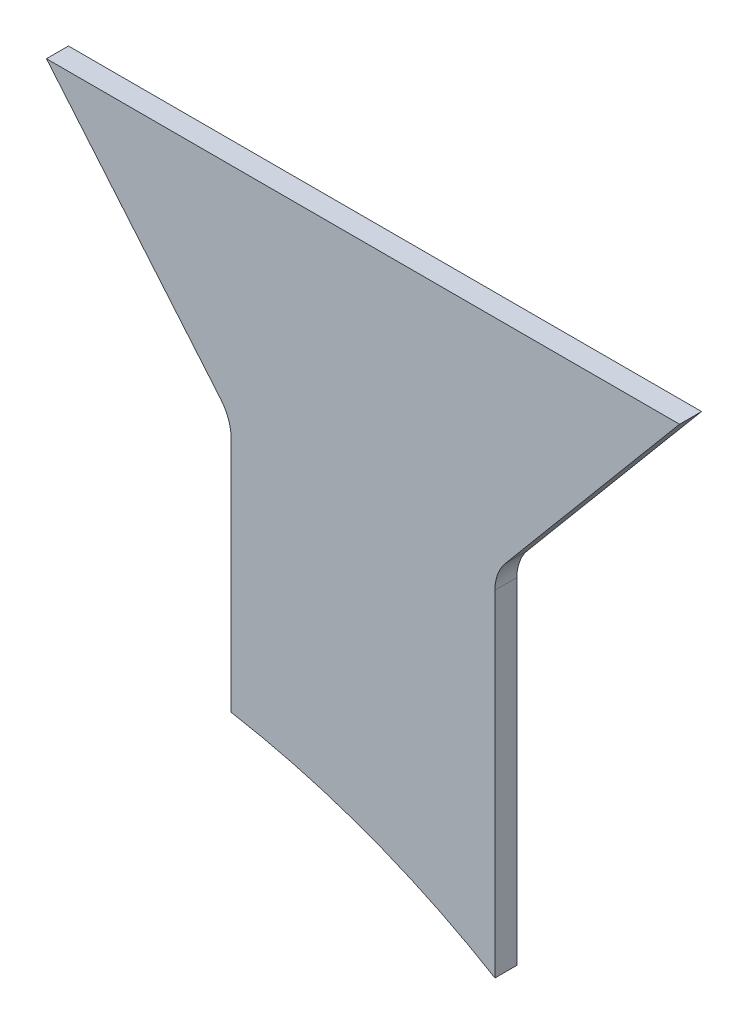
ISO-10303-21;
HEADER;
FILE_DESCRIPTION(('STEP AP214'),'2;1');
FILE_NAME('part.step','',(''),(''),'','','');
FILE_SCHEMA(('AUTOMOTIVE_DESIGN { 1 0 10303 214 1 1 1 1 }'));
ENDSEC;
DATA;
#1=APPLICATION_CONTEXT('core data for automotive mechanical design processes');
#2=APPLICATION_PROTOCOL_DEFINITION('international standard','automotive_design',2000,#1);
#3=PRODUCT_CONTEXT('',#1,'mechanical');
#4=PRODUCT('Part','Part','',(#3));
#5=PRODUCT_RELATED_PRODUCT_CATEGORY('part','',(#4));
#6=PRODUCT_DEFINITION_FORMATION('','',#4);
#7=PRODUCT_DEFINITION_CONTEXT('part definition',#1,'design');
#8=PRODUCT_DEFINITION('design','',#6,#7);
#9=PRODUCT_DEFINITION_SHAPE('','',#8);
#10=(LENGTH_UNIT() NAMED_UNIT(*) SI_UNIT(.MILLI.,.METRE.));
#11=(NAMED_UNIT(*) PLANE_ANGLE_UNIT() SI_UNIT($,.RADIAN.));
#12=(NAMED_UNIT(*) SI_UNIT($,.STERADIAN.) SOLID_ANGLE_UNIT());
#13=UNCERTAINTY_MEASURE_WITH_UNIT(LENGTH_MEASURE(1.E-05),#10,'distance_accuracy_value','');
#14=(GEOMETRIC_REPRESENTATION_CONTEXT(3) GLOBAL_UNCERTAINTY_ASSIGNED_CONTEXT((#13)) GLOBAL_UNIT_ASSIGNED_CONTEXT((#10,
#11,#12)) REPRESENTATION_CONTEXT('',''));
#15=CARTESIAN_POINT('',(0.,0.,0.));
#16=DIRECTION('',(0.,0.,1.));
#17=DIRECTION('',(1.,0.,0.));
#18=AXIS2_PLACEMENT_3D('',#15,#16,#17);
#19=CARTESIAN_POINT('',(-60.,-150.083310198036,5.));
#20=DIRECTION('',(0.,0.,-1.));
#21=DIRECTION('',(-1.,0.,0.));
#22=AXIS2_PLACEMENT_3D('',#19,#20,#21);
#23=CYLINDRICAL_SURFACE('',#22,175.);
#24=CARTESIAN_POINT('',(-60.,-150.083310198036,0.));
#25=DIRECTION('',(0.,0.,-1.));
#26=DIRECTION('',(1.,0.,0.));
#27=AXIS2_PLACEMENT_3D('',#24,#25,#26);
#28=CIRCLE('',#27,175.);
#29=CARTESIAN_POINT('',(-30.,22.3260862976303,0.));
#30=VERTEX_POINT('',#29);
#31=CARTESIAN_POINT('',(30.,0.,0.));
#32=VERTEX_POINT('',#31);
#33=EDGE_CURVE('E118',#30,#32,#28,.T.);
#34=ORIENTED_EDGE('',*,*,#33,.T.);
#35=DIRECTION('',(0.,0.,-1.));
#36=VECTOR('',#35,1.);
#37=CARTESIAN_POINT('',(30.,0.,5.));
#38=LINE('',#37,#36);
#39=CARTESIAN_POINT('',(30.,0.,5.));
#40=VERTEX_POINT('',#39);
#41=EDGE_CURVE('E101',#40,#32,#38,.T.);
#42=ORIENTED_EDGE('',*,*,#41,.F.);
#43=CARTESIAN_POINT('',(-60.,-150.083310198036,5.));
#44=DIRECTION('',(0.,0.,-1.));
#45=DIRECTION('',(1.,0.,0.));
#46=AXIS2_PLACEMENT_3D('',#43,#44,#45);
#47=CIRCLE('',#46,175.);
#48=CARTESIAN_POINT('',(-30.,22.3260862976303,5.));
#49=VERTEX_POINT('',#48);
#50=EDGE_CURVE('E106',#49,#40,#47,.T.);
#51=ORIENTED_EDGE('',*,*,#50,.F.);
#52=DIRECTION('',(0.,0.,-1.));
#53=VECTOR('',#52,1.);
#54=CARTESIAN_POINT('',(-30.,22.3260862976303,5.));
#55=LINE('',#54,#53);
#56=EDGE_CURVE('E148',#49,#30,#55,.T.);
#57=ORIENTED_EDGE('',*,*,#56,.T.);
#58=EDGE_LOOP('',(#34,#42,#51,#57));
#59=FACE_BOUND('',#58,.T.);
#60=ADVANCED_FACE('F36',(#59),#23,.F.);
#61=CARTESIAN_POINT('',(30.,0.,5.));
#62=DIRECTION('',(-1.,0.,0.));
#63=DIRECTION('',(0.,-1.,0.));
#64=AXIS2_PLACEMENT_3D('',#61,#62,#63);
#65=PLANE('',#64);
#66=DIRECTION('',(0.,1.,0.));
#67=VECTOR('',#66,1.);
#68=CARTESIAN_POINT('',(30.,0.,0.));
#69=LINE('',#68,#67);
#70=CARTESIAN_POINT('',(30.,76.360297657338,0.));
#71=VERTEX_POINT('',#70);
#72=EDGE_CURVE('E167',#32,#71,#69,.T.);
#73=ORIENTED_EDGE('',*,*,#72,.T.);
#74=DIRECTION('',(0.,0.,-1.));
#75=VECTOR('',#74,1.);
#76=CARTESIAN_POINT('',(30.,76.360297657338,5.));
#77=LINE('',#76,#75);
#78=CARTESIAN_POINT('',(30.,76.360297657338,5.));
#79=VERTEX_POINT('',#78);
#80=EDGE_CURVE('E51',#71,#79,#77,.F.);
#81=ORIENTED_EDGE('',*,*,#80,.T.);
#82=DIRECTION('',(0.,1.,0.));
#83=VECTOR('',#82,1.);
#84=CARTESIAN_POINT('',(30.,0.,5.));
#85=LINE('',#84,#83);
#86=EDGE_CURVE('E97',#40,#79,#85,.T.);
#87=ORIENTED_EDGE('',*,*,#86,.F.);
#88=ORIENTED_EDGE('',*,*,#41,.T.);
#89=EDGE_LOOP('',(#73,#81,#87,#88));
#90=FACE_BOUND('',#89,.T.);
#91=ADVANCED_FACE('F99',(#90),#65,.F.);
#92=CARTESIAN_POINT('',(30.,80.,5.));
#93=DIRECTION('',(-0.766044443118977,0.64278760968654,0.));
#94=DIRECTION('',(-0.64278760968654,-0.766044443118977,0.));
#95=AXIS2_PLACEMENT_3D('',#92,#93,#94);
#96=PLANE('',#95);
#97=DIRECTION('',(0.64278760968654,0.766044443118977,0.));
#98=VECTOR('',#97,1.);
#99=CARTESIAN_POINT('',(30.,80.,5.));
#100=LINE('',#99,#98);
#101=CARTESIAN_POINT('',(32.3395555688102,82.7881737542034,5.));
#102=VERTEX_POINT('',#101);
#103=CARTESIAN_POINT('',(71.9740309125311,130.022702135669,5.));
#104=VERTEX_POINT('',#103);
#105=EDGE_CURVE('E105',#102,#104,#100,.T.);
#106=ORIENTED_EDGE('',*,*,#105,.F.);
#107=DIRECTION('',(0.,0.,-1.));
#108=VECTOR('',#107,1.);
#109=CARTESIAN_POINT('',(32.3395555688102,82.7881737542034,0.));
#110=LINE('',#109,#108);
#111=CARTESIAN_POINT('',(32.3395555688102,82.7881737542034,0.));
#112=VERTEX_POINT('',#111);
#113=EDGE_CURVE('E131',#102,#112,#110,.T.);
#114=ORIENTED_EDGE('',*,*,#113,.T.);
#115=DIRECTION('',(0.64278760968654,0.766044443118977,0.));
#116=VECTOR('',#115,1.);
#117=CARTESIAN_POINT('',(30.,80.,0.));
#118=LINE('',#117,#116);
#119=CARTESIAN_POINT('',(71.9740309125311,130.022702135669,0.));
#120=VERTEX_POINT('',#119);
#121=EDGE_CURVE('E163',#112,#120,#118,.T.);
#122=ORIENTED_EDGE('',*,*,#121,.T.);
#123=DIRECTION('',(0.,0.,-1.));
#124=VECTOR('',#123,1.);
#125=CARTESIAN_POINT('',(71.9740309125311,130.022702135669,5.));
#126=LINE('',#125,#124);
#127=EDGE_CURVE('E120',#104,#120,#126,.T.);
#128=ORIENTED_EDGE('',*,*,#127,.F.);
#129=EDGE_LOOP('',(#106,#114,#122,#128));
#130=FACE_BOUND('',#129,.T.);
#131=ADVANCED_FACE('F174',(#130),#96,.F.);
#132=CARTESIAN_POINT('',(-71.9740309125311,130.022702135669,5.));
#133=DIRECTION('',(0.,-1.,0.));
#134=DIRECTION('',(0.,0.,-1.));
#135=AXIS2_PLACEMENT_3D('',#132,#133,#134);
#136=PLANE('',#135);
#137=DIRECTION('',(-1.,0.,0.));
#138=VECTOR('',#137,1.);
#139=CARTESIAN_POINT('',(-71.9740309125311,130.022702135669,0.));
#140=LINE('',#139,#138);
#141=CARTESIAN_POINT('',(-71.9740309125311,130.022702135669,0.));
#142=VERTEX_POINT('',#141);
#143=EDGE_CURVE('E160',#120,#142,#140,.T.);
#144=ORIENTED_EDGE('',*,*,#143,.T.);
#145=DIRECTION('',(0.,0.,-1.));
#146=VECTOR('',#145,1.);
#147=CARTESIAN_POINT('',(-71.9740309125311,130.022702135669,5.));
#148=LINE('',#147,#146);
#149=CARTESIAN_POINT('',(-71.9740309125311,130.022702135669,5.));
#150=VERTEX_POINT('',#149);
#151=EDGE_CURVE('E126',#150,#142,#148,.T.);
#152=ORIENTED_EDGE('',*,*,#151,.F.);
#153=DIRECTION('',(-1.,0.,0.));
#154=VECTOR('',#153,1.);
#155=CARTESIAN_POINT('',(-71.9740309125311,130.022702135669,5.));
#156=LINE('',#155,#154);
#157=EDGE_CURVE('E179',#104,#150,#156,.T.);
#158=ORIENTED_EDGE('',*,*,#157,.F.);
#159=ORIENTED_EDGE('',*,*,#127,.T.);
#160=EDGE_LOOP('',(#144,#152,#158,#159));
#161=FACE_BOUND('',#160,.T.);
#162=ADVANCED_FACE('F178',(#161),#136,.F.);
#163=CARTESIAN_POINT('',(-30.,80.,5.));
#164=DIRECTION('',(0.766044443118977,0.64278760968654,0.));
#165=DIRECTION('',(-0.64278760968654,0.766044443118977,0.));
#166=AXIS2_PLACEMENT_3D('',#163,#164,#165);
#167=PLANE('',#166);
#168=DIRECTION('',(0.64278760968654,-0.766044443118977,0.));
#169=VECTOR('',#168,1.);
#170=CARTESIAN_POINT('',(-30.,80.,0.));
#171=LINE('',#170,#169);
#172=CARTESIAN_POINT('',(-32.3395555688102,82.7881737542034,0.));
#173=VERTEX_POINT('',#172);
#174=EDGE_CURVE('E155',#142,#173,#171,.T.);
#175=ORIENTED_EDGE('',*,*,#174,.T.);
#176=DIRECTION('',(0.,0.,-1.));
#177=VECTOR('',#176,1.);
#178=CARTESIAN_POINT('',(-32.3395555688102,82.7881737542034,5.));
#179=LINE('',#178,#177);
#180=CARTESIAN_POINT('',(-32.3395555688102,82.7881737542034,5.));
#181=VERTEX_POINT('',#180);
#182=EDGE_CURVE('E123',#173,#181,#179,.F.);
#183=ORIENTED_EDGE('',*,*,#182,.T.);
#184=DIRECTION('',(0.64278760968654,-0.766044443118977,0.));
#185=VECTOR('',#184,1.);
#186=CARTESIAN_POINT('',(-30.,80.,5.));
#187=LINE('',#186,#185);
#188=EDGE_CURVE('E141',#150,#181,#187,.T.);
#189=ORIENTED_EDGE('',*,*,#188,.F.);
#190=ORIENTED_EDGE('',*,*,#151,.T.);
#191=EDGE_LOOP('',(#175,#183,#189,#190));
#192=FACE_BOUND('',#191,.T.);
#193=ADVANCED_FACE('F158',(#192),#167,.F.);
#194=CARTESIAN_POINT('',(-30.,22.3260862976303,5.));
#195=DIRECTION('',(1.,0.,0.));
#196=DIRECTION('',(0.,1.,0.));
#197=AXIS2_PLACEMENT_3D('',#194,#195,#196);
#198=PLANE('',#197);
#199=DIRECTION('',(0.,-1.,0.));
#200=VECTOR('',#199,1.);
#201=CARTESIAN_POINT('',(-30.,22.3260862976303,5.));
#202=LINE('',#201,#200);
#203=CARTESIAN_POINT('',(-30.,76.360297657338,5.));
#204=VERTEX_POINT('',#203);
#205=EDGE_CURVE('E111',#204,#49,#202,.T.);
#206=ORIENTED_EDGE('',*,*,#205,.F.);
#207=DIRECTION('',(0.,0.,-1.));
#208=VECTOR('',#207,1.);
#209=CARTESIAN_POINT('',(-30.,76.360297657338,0.));
#210=LINE('',#209,#208);
#211=CARTESIAN_POINT('',(-30.,76.360297657338,0.));
#212=VERTEX_POINT('',#211);
#213=EDGE_CURVE('E119',#204,#212,#210,.T.);
#214=ORIENTED_EDGE('',*,*,#213,.T.);
#215=DIRECTION('',(0.,-1.,0.));
#216=VECTOR('',#215,1.);
#217=CARTESIAN_POINT('',(-30.,22.3260862976303,0.));
#218=LINE('',#217,#216);
#219=EDGE_CURVE('E115',#212,#30,#218,.T.);
#220=ORIENTED_EDGE('',*,*,#219,.T.);
#221=ORIENTED_EDGE('',*,*,#56,.F.);
#222=EDGE_LOOP('',(#206,#214,#220,#221));
#223=FACE_BOUND('',#222,.T.);
#224=ADVANCED_FACE('F146',(#223),#198,.F.);
#225=CARTESIAN_POINT('',(-60.,-150.083310198036,5.));
#226=DIRECTION('',(0.,0.,1.));
#227=DIRECTION('',(1.,0.,0.));
#228=AXIS2_PLACEMENT_3D('',#225,#226,#227);
#229=PLANE('',#228);
#230=ORIENTED_EDGE('',*,*,#50,.T.);
#231=ORIENTED_EDGE('',*,*,#86,.T.);
#232=CARTESIAN_POINT('',(40.,76.360297657338,5.));
#233=DIRECTION('',(0.,0.,1.));
#234=DIRECTION('',(1.,0.,0.));
#235=AXIS2_PLACEMENT_3D('',#232,#233,#234);
#236=CIRCLE('',#235,10.);
#237=EDGE_CURVE('E11',#79,#102,#236,.F.);
#238=ORIENTED_EDGE('',*,*,#237,.T.);
#239=ORIENTED_EDGE('',*,*,#105,.T.);
#240=ORIENTED_EDGE('',*,*,#157,.T.);
#241=ORIENTED_EDGE('',*,*,#188,.T.);
#242=CARTESIAN_POINT('',(-40.,76.360297657338,5.));
#243=DIRECTION('',(0.,0.,1.));
#244=DIRECTION('',(1.,0.,0.));
#245=AXIS2_PLACEMENT_3D('',#242,#243,#244);
#246=CIRCLE('',#245,10.);
#247=EDGE_CURVE('E137',#181,#204,#246,.F.);
#248=ORIENTED_EDGE('',*,*,#247,.T.);
#249=ORIENTED_EDGE('',*,*,#205,.T.);
#250=EDGE_LOOP('',(#230,#231,#238,#239,#240,#241,#248,#249));
#251=FACE_BOUND('',#250,.T.);
#252=ADVANCED_FACE('F109',(#251),#229,.T.);
#253=CARTESIAN_POINT('',(-60.,-150.083310198036,0.));
#254=DIRECTION('',(0.,0.,1.));
#255=DIRECTION('',(1.,0.,0.));
#256=AXIS2_PLACEMENT_3D('',#253,#254,#255);
#257=PLANE('',#256);
#258=ORIENTED_EDGE('',*,*,#33,.F.);
#259=ORIENTED_EDGE('',*,*,#219,.F.);
#260=CARTESIAN_POINT('',(-40.,76.360297657338,0.));
#261=DIRECTION('',(0.,0.,1.));
#262=DIRECTION('',(1.,0.,0.));
#263=AXIS2_PLACEMENT_3D('',#260,#261,#262);
#264=CIRCLE('',#263,10.);
#265=EDGE_CURVE('E135',#212,#173,#264,.T.);
#266=ORIENTED_EDGE('',*,*,#265,.T.);
#267=ORIENTED_EDGE('',*,*,#174,.F.);
#268=ORIENTED_EDGE('',*,*,#143,.F.);
#269=ORIENTED_EDGE('',*,*,#121,.F.);
#270=CARTESIAN_POINT('',(40.,76.360297657338,0.));
#271=DIRECTION('',(0.,0.,1.));
#272=DIRECTION('',(1.,0.,0.));
#273=AXIS2_PLACEMENT_3D('',#270,#271,#272);
#274=CIRCLE('',#273,10.);
#275=EDGE_CURVE('E44',#112,#71,#274,.T.);
#276=ORIENTED_EDGE('',*,*,#275,.T.);
#277=ORIENTED_EDGE('',*,*,#72,.F.);
#278=EDGE_LOOP('',(#258,#259,#266,#267,#268,#269,#276,#277));
#279=FACE_BOUND('',#278,.T.);
#280=ADVANCED_FACE('F153',(#279),#257,.F.);
#281=CARTESIAN_POINT('',(-40.,76.360297657338,5.));
#282=DIRECTION('',(0.,0.,1.));
#283=DIRECTION('',(1.,0.,0.));
#284=AXIS2_PLACEMENT_3D('',#281,#282,#283);
#285=CYLINDRICAL_SURFACE('',#284,10.);
#286=ORIENTED_EDGE('',*,*,#247,.F.);
#287=ORIENTED_EDGE('',*,*,#182,.F.);
#288=ORIENTED_EDGE('',*,*,#265,.F.);
#289=ORIENTED_EDGE('',*,*,#213,.F.);
#290=EDGE_LOOP('',(#286,#287,#288,#289));
#291=FACE_BOUND('',#290,.T.);
#292=ADVANCED_FACE('F150',(#291),#285,.F.);
#293=CARTESIAN_POINT('',(40.,76.360297657338,5.));
#294=DIRECTION('',(0.,0.,1.));
#295=DIRECTION('',(1.,0.,0.));
#296=AXIS2_PLACEMENT_3D('',#293,#294,#295);
#297=CYLINDRICAL_SURFACE('',#296,10.);
#298=ORIENTED_EDGE('',*,*,#237,.F.);
#299=ORIENTED_EDGE('',*,*,#80,.F.);
#300=ORIENTED_EDGE('',*,*,#275,.F.);
#301=ORIENTED_EDGE('',*,*,#113,.F.);
#302=EDGE_LOOP('',(#298,#299,#300,#301));
#303=FACE_BOUND('',#302,.T.);
#304=ADVANCED_FACE('F38',(#303),#297,.F.);
#305=CLOSED_SHELL('',(#60,#91,#131,#162,#193,#224,#252,#280,#292,#304));
#306=MANIFOLD_SOLID_BREP('B2',#305);
#307=ADVANCED_BREP_SHAPE_REPRESENTATION('',(#18,#306),#14);
#308=SHAPE_DEFINITION_REPRESENTATION(#9,#307);
ENDSEC;
END-ISO-10303-21;
